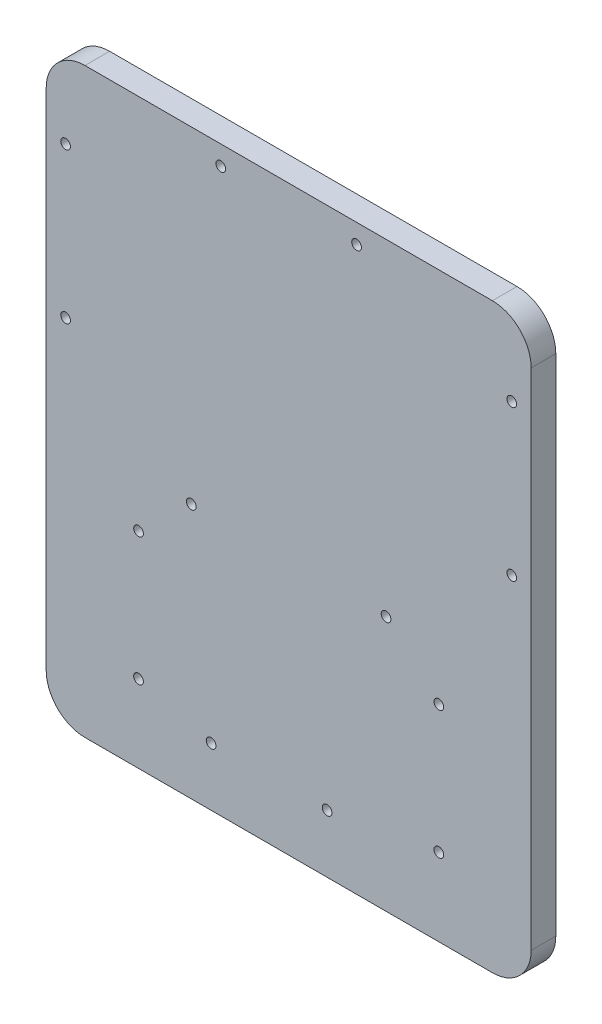
ISO-10303-21;
HEADER;
FILE_DESCRIPTION(('STEP AP214'),'2;1');
FILE_NAME('part.step','',(''),(''),'','','');
FILE_SCHEMA(('AUTOMOTIVE_DESIGN { 1 0 10303 214 1 1 1 1 }'));
ENDSEC;
DATA;
#1=APPLICATION_CONTEXT('core data for automotive mechanical design processes');
#2=APPLICATION_PROTOCOL_DEFINITION('international standard','automotive_design',2000,#1);
#3=PRODUCT_CONTEXT('',#1,'mechanical');
#4=PRODUCT('Part','Part','',(#3));
#5=PRODUCT_RELATED_PRODUCT_CATEGORY('part','',(#4));
#6=PRODUCT_DEFINITION_FORMATION('','',#4);
#7=PRODUCT_DEFINITION_CONTEXT('part definition',#1,'design');
#8=PRODUCT_DEFINITION('design','',#6,#7);
#9=PRODUCT_DEFINITION_SHAPE('','',#8);
#10=(LENGTH_UNIT() NAMED_UNIT(*) SI_UNIT(.MILLI.,.METRE.));
#11=(NAMED_UNIT(*) PLANE_ANGLE_UNIT() SI_UNIT($,.RADIAN.));
#12=(NAMED_UNIT(*) SI_UNIT($,.STERADIAN.) SOLID_ANGLE_UNIT());
#13=UNCERTAINTY_MEASURE_WITH_UNIT(LENGTH_MEASURE(1.E-05),#10,'distance_accuracy_value','');
#14=(GEOMETRIC_REPRESENTATION_CONTEXT(3) GLOBAL_UNCERTAINTY_ASSIGNED_CONTEXT((#13)) GLOBAL_UNIT_ASSIGNED_CONTEXT((#10,
#11,#12)) REPRESENTATION_CONTEXT('',''));
#15=CARTESIAN_POINT('',(0.,0.,0.));
#16=DIRECTION('',(0.,0.,1.));
#17=DIRECTION('',(1.,0.,0.));
#18=AXIS2_PLACEMENT_3D('',#15,#16,#17);
#19=CARTESIAN_POINT('',(0.,0.,6.35));
#20=DIRECTION('',(0.,0.,1.));
#21=DIRECTION('',(1.,0.,0.));
#22=AXIS2_PLACEMENT_3D('',#19,#20,#21);
#23=PLANE('',#22);
#24=CARTESIAN_POINT('',(-57.5,55.,6.35));
#25=DIRECTION('',(0.,0.,1.));
#26=DIRECTION('',(-1.,0.,0.));
#27=AXIS2_PLACEMENT_3D('',#24,#25,#26);
#28=CIRCLE('',#27,1.25);
#29=CARTESIAN_POINT('',(-58.75,55.,6.35));
#30=VERTEX_POINT('',#29);
#31=EDGE_CURVE('E252',#30,#30,#28,.T.);
#32=ORIENTED_EDGE('',*,*,#31,.F.);
#33=EDGE_LOOP('',(#32));
#34=FACE_BOUND('',#33,.T.);
#35=CARTESIAN_POINT('',(-57.5,16.2,6.35));
#36=DIRECTION('',(0.,0.,1.));
#37=DIRECTION('',(-1.,0.,0.));
#38=AXIS2_PLACEMENT_3D('',#35,#36,#37);
#39=CIRCLE('',#38,1.25);
#40=CARTESIAN_POINT('',(-58.75,16.2,6.35));
#41=VERTEX_POINT('',#40);
#42=EDGE_CURVE('E246',#41,#41,#39,.T.);
#43=ORIENTED_EDGE('',*,*,#42,.F.);
#44=EDGE_LOOP('',(#43));
#45=FACE_BOUND('',#44,.T.);
#46=CARTESIAN_POINT('',(57.5,16.2,6.35));
#47=DIRECTION('',(0.,0.,1.));
#48=DIRECTION('',(1.,0.,0.));
#49=AXIS2_PLACEMENT_3D('',#46,#47,#48);
#50=CIRCLE('',#49,1.25);
#51=CARTESIAN_POINT('',(58.75,16.2,6.35));
#52=VERTEX_POINT('',#51);
#53=EDGE_CURVE('E240',#52,#52,#50,.T.);
#54=ORIENTED_EDGE('',*,*,#53,.F.);
#55=EDGE_LOOP('',(#54));
#56=FACE_BOUND('',#55,.T.);
#57=CARTESIAN_POINT('',(57.5,55.,6.35));
#58=DIRECTION('',(0.,0.,1.));
#59=DIRECTION('',(1.,0.,0.));
#60=AXIS2_PLACEMENT_3D('',#57,#58,#59);
#61=CIRCLE('',#60,1.25);
#62=CARTESIAN_POINT('',(58.75,55.,6.35));
#63=VERTEX_POINT('',#62);
#64=EDGE_CURVE('E234',#63,#63,#61,.T.);
#65=ORIENTED_EDGE('',*,*,#64,.F.);
#66=EDGE_LOOP('',(#65));
#67=FACE_BOUND('',#66,.T.);
#68=CARTESIAN_POINT('',(-38.7000000000001,-22.,6.35));
#69=DIRECTION('',(0.,0.,1.));
#70=DIRECTION('',(-1.,0.,0.));
#71=AXIS2_PLACEMENT_3D('',#68,#69,#70);
#72=CIRCLE('',#71,1.25);
#73=CARTESIAN_POINT('',(-39.9500000000001,-22.,6.35));
#74=VERTEX_POINT('',#73);
#75=EDGE_CURVE('E217',#74,#74,#72,.T.);
#76=ORIENTED_EDGE('',*,*,#75,.F.);
#77=EDGE_LOOP('',(#76));
#78=FACE_BOUND('',#77,.T.);
#79=CARTESIAN_POINT('',(38.7,-55.,6.35));
#80=DIRECTION('',(0.,0.,1.));
#81=DIRECTION('',(1.,0.,0.));
#82=AXIS2_PLACEMENT_3D('',#79,#80,#81);
#83=CIRCLE('',#82,1.25);
#84=CARTESIAN_POINT('',(39.95,-55.,6.35));
#85=VERTEX_POINT('',#84);
#86=EDGE_CURVE('E205',#85,#85,#83,.T.);
#87=ORIENTED_EDGE('',*,*,#86,.F.);
#88=EDGE_LOOP('',(#87));
#89=FACE_BOUND('',#88,.T.);
#90=CARTESIAN_POINT('',(-17.5,70.,6.35));
#91=DIRECTION('',(0.,0.,1.));
#92=DIRECTION('',(1.,0.,0.));
#93=AXIS2_PLACEMENT_3D('',#90,#91,#92);
#94=CIRCLE('',#93,1.25);
#95=CARTESIAN_POINT('',(-16.25,70.,6.35));
#96=VERTEX_POINT('',#95);
#97=EDGE_CURVE('E193',#96,#96,#94,.T.);
#98=ORIENTED_EDGE('',*,*,#97,.F.);
#99=EDGE_LOOP('',(#98));
#100=FACE_BOUND('',#99,.T.);
#101=CARTESIAN_POINT('',(-20.,-60.,6.35));
#102=DIRECTION('',(0.,0.,1.));
#103=DIRECTION('',(1.,0.,0.));
#104=AXIS2_PLACEMENT_3D('',#101,#102,#103);
#105=CIRCLE('',#104,1.25);
#106=CARTESIAN_POINT('',(-18.75,-60.,6.35));
#107=VERTEX_POINT('',#106);
#108=EDGE_CURVE('E181',#107,#107,#105,.T.);
#109=ORIENTED_EDGE('',*,*,#108,.F.);
#110=EDGE_LOOP('',(#109));
#111=FACE_BOUND('',#110,.T.);
#112=CARTESIAN_POINT('',(-25.1,-9.19999999999999,6.35));
#113=DIRECTION('',(0.,0.,1.));
#114=DIRECTION('',(1.,0.,0.));
#115=AXIS2_PLACEMENT_3D('',#112,#113,#114);
#116=CIRCLE('',#115,1.25);
#117=CARTESIAN_POINT('',(-23.85,-9.19999999999999,6.35));
#118=VERTEX_POINT('',#117);
#119=EDGE_CURVE('E164',#118,#118,#116,.T.);
#120=ORIENTED_EDGE('',*,*,#119,.F.);
#121=EDGE_LOOP('',(#120));
#122=FACE_BOUND('',#121,.T.);
#123=DIRECTION('',(0.,-1.,0.));
#124=VECTOR('',#123,1.);
#125=CARTESIAN_POINT('',(-62.5,75.,6.35));
#126=LINE('',#125,#124);
#127=CARTESIAN_POINT('',(-62.5,65.,6.35));
#128=VERTEX_POINT('',#127);
#129=CARTESIAN_POINT('',(-62.5,-65.,6.35));
#130=VERTEX_POINT('',#129);
#131=EDGE_CURVE('E171',#128,#130,#126,.T.);
#132=ORIENTED_EDGE('',*,*,#131,.T.);
#133=CARTESIAN_POINT('',(-52.5,-65.,6.35));
#134=DIRECTION('',(0.,0.,1.));
#135=DIRECTION('',(1.,0.,0.));
#136=AXIS2_PLACEMENT_3D('',#133,#134,#135);
#137=CIRCLE('',#136,10.);
#138=CARTESIAN_POINT('',(-52.5,-75.,6.35));
#139=VERTEX_POINT('',#138);
#140=EDGE_CURVE('E148',#130,#139,#137,.T.);
#141=ORIENTED_EDGE('',*,*,#140,.T.);
#142=DIRECTION('',(1.,0.,0.));
#143=VECTOR('',#142,1.);
#144=CARTESIAN_POINT('',(-62.5,-75.,6.35));
#145=LINE('',#144,#143);
#146=CARTESIAN_POINT('',(52.5,-75.,6.35));
#147=VERTEX_POINT('',#146);
#148=EDGE_CURVE('E119',#139,#147,#145,.T.);
#149=ORIENTED_EDGE('',*,*,#148,.T.);
#150=CARTESIAN_POINT('',(52.5,-65.,6.35));
#151=DIRECTION('',(0.,0.,1.));
#152=DIRECTION('',(1.,0.,0.));
#153=AXIS2_PLACEMENT_3D('',#150,#151,#152);
#154=CIRCLE('',#153,10.);
#155=CARTESIAN_POINT('',(62.5,-65.,6.35));
#156=VERTEX_POINT('',#155);
#157=EDGE_CURVE('E146',#147,#156,#154,.T.);
#158=ORIENTED_EDGE('',*,*,#157,.T.);
#159=DIRECTION('',(0.,1.,0.));
#160=VECTOR('',#159,1.);
#161=CARTESIAN_POINT('',(62.5,75.,6.35));
#162=LINE('',#161,#160);
#163=CARTESIAN_POINT('',(62.5,65.,6.35));
#164=VERTEX_POINT('',#163);
#165=EDGE_CURVE('E126',#156,#164,#162,.T.);
#166=ORIENTED_EDGE('',*,*,#165,.T.);
#167=CARTESIAN_POINT('',(52.5,65.,6.35));
#168=DIRECTION('',(0.,0.,1.));
#169=DIRECTION('',(1.,0.,0.));
#170=AXIS2_PLACEMENT_3D('',#167,#168,#169);
#171=CIRCLE('',#170,10.);
#172=CARTESIAN_POINT('',(52.5,75.,6.35));
#173=VERTEX_POINT('',#172);
#174=EDGE_CURVE('E54',#164,#173,#171,.T.);
#175=ORIENTED_EDGE('',*,*,#174,.T.);
#176=DIRECTION('',(-1.,0.,0.));
#177=VECTOR('',#176,1.);
#178=CARTESIAN_POINT('',(-62.5,75.,6.35));
#179=LINE('',#178,#177);
#180=CARTESIAN_POINT('',(-52.5,75.,6.35));
#181=VERTEX_POINT('',#180);
#182=EDGE_CURVE('E129',#173,#181,#179,.T.);
#183=ORIENTED_EDGE('',*,*,#182,.T.);
#184=CARTESIAN_POINT('',(-52.5,65.,6.35));
#185=DIRECTION('',(0.,0.,1.));
#186=DIRECTION('',(1.,0.,0.));
#187=AXIS2_PLACEMENT_3D('',#184,#185,#186);
#188=CIRCLE('',#187,10.);
#189=EDGE_CURVE('E143',#181,#128,#188,.T.);
#190=ORIENTED_EDGE('',*,*,#189,.T.);
#191=EDGE_LOOP('',(#132,#141,#149,#158,#166,#175,#183,#190));
#192=FACE_BOUND('',#191,.T.);
#193=CARTESIAN_POINT('',(25.1,-9.19999999999999,6.35));
#194=DIRECTION('',(0.,0.,1.));
#195=DIRECTION('',(1.,0.,0.));
#196=AXIS2_PLACEMENT_3D('',#193,#194,#195);
#197=CIRCLE('',#196,1.25);
#198=CARTESIAN_POINT('',(26.35,-9.19999999999999,6.35));
#199=VERTEX_POINT('',#198);
#200=EDGE_CURVE('E176',#199,#199,#197,.T.);
#201=ORIENTED_EDGE('',*,*,#200,.F.);
#202=EDGE_LOOP('',(#201));
#203=FACE_BOUND('',#202,.T.);
#204=CARTESIAN_POINT('',(9.9,-60.,6.35));
#205=DIRECTION('',(0.,0.,1.));
#206=DIRECTION('',(1.,0.,0.));
#207=AXIS2_PLACEMENT_3D('',#204,#205,#206);
#208=CIRCLE('',#207,1.25);
#209=CARTESIAN_POINT('',(11.15,-60.,6.35));
#210=VERTEX_POINT('',#209);
#211=EDGE_CURVE('E187',#210,#210,#208,.T.);
#212=ORIENTED_EDGE('',*,*,#211,.F.);
#213=EDGE_LOOP('',(#212));
#214=FACE_BOUND('',#213,.T.);
#215=CARTESIAN_POINT('',(17.5,70.,6.35));
#216=DIRECTION('',(0.,0.,1.));
#217=DIRECTION('',(1.,0.,0.));
#218=AXIS2_PLACEMENT_3D('',#215,#216,#217);
#219=CIRCLE('',#218,1.25);
#220=CARTESIAN_POINT('',(18.75,70.,6.35));
#221=VERTEX_POINT('',#220);
#222=EDGE_CURVE('E199',#221,#221,#219,.T.);
#223=ORIENTED_EDGE('',*,*,#222,.F.);
#224=EDGE_LOOP('',(#223));
#225=FACE_BOUND('',#224,.T.);
#226=CARTESIAN_POINT('',(38.7000000000001,-22.,6.35));
#227=DIRECTION('',(0.,0.,1.));
#228=DIRECTION('',(1.,0.,0.));
#229=AXIS2_PLACEMENT_3D('',#226,#227,#228);
#230=CIRCLE('',#229,1.25);
#231=CARTESIAN_POINT('',(39.9500000000001,-22.,6.35));
#232=VERTEX_POINT('',#231);
#233=EDGE_CURVE('E211',#232,#232,#230,.T.);
#234=ORIENTED_EDGE('',*,*,#233,.F.);
#235=EDGE_LOOP('',(#234));
#236=FACE_BOUND('',#235,.T.);
#237=CARTESIAN_POINT('',(-38.7,-55.,6.35));
#238=DIRECTION('',(0.,0.,1.));
#239=DIRECTION('',(-1.,0.,0.));
#240=AXIS2_PLACEMENT_3D('',#237,#238,#239);
#241=CIRCLE('',#240,1.25);
#242=CARTESIAN_POINT('',(-39.95,-55.,6.35));
#243=VERTEX_POINT('',#242);
#244=EDGE_CURVE('E223',#243,#243,#241,.T.);
#245=ORIENTED_EDGE('',*,*,#244,.F.);
#246=EDGE_LOOP('',(#245));
#247=FACE_BOUND('',#246,.T.);
#248=ADVANCED_FACE('F33',(#34,#45,#56,#67,#78,#89,#100,#111,#122,#192,#203,#214,#225,#236,#247),
#23,.T.);
#249=CARTESIAN_POINT('',(0.,0.,0.));
#250=DIRECTION('',(0.,0.,1.));
#251=DIRECTION('',(1.,0.,0.));
#252=AXIS2_PLACEMENT_3D('',#249,#250,#251);
#253=PLANE('',#252);
#254=CARTESIAN_POINT('',(-57.5,55.,0.));
#255=DIRECTION('',(0.,0.,1.));
#256=DIRECTION('',(1.,0.,0.));
#257=AXIS2_PLACEMENT_3D('',#254,#255,#256);
#258=CIRCLE('',#257,1.25);
#259=CARTESIAN_POINT('',(-56.25,55.,0.));
#260=VERTEX_POINT('',#259);
#261=EDGE_CURVE('E249',#260,#260,#258,.F.);
#262=ORIENTED_EDGE('',*,*,#261,.F.);
#263=EDGE_LOOP('',(#262));
#264=FACE_BOUND('',#263,.T.);
#265=CARTESIAN_POINT('',(-57.5,16.2,0.));
#266=DIRECTION('',(0.,0.,1.));
#267=DIRECTION('',(1.,0.,0.));
#268=AXIS2_PLACEMENT_3D('',#265,#266,#267);
#269=CIRCLE('',#268,1.25);
#270=CARTESIAN_POINT('',(-56.25,16.2,0.));
#271=VERTEX_POINT('',#270);
#272=EDGE_CURVE('E243',#271,#271,#269,.F.);
#273=ORIENTED_EDGE('',*,*,#272,.F.);
#274=EDGE_LOOP('',(#273));
#275=FACE_BOUND('',#274,.T.);
#276=CARTESIAN_POINT('',(57.5,16.2,0.));
#277=DIRECTION('',(0.,0.,1.));
#278=DIRECTION('',(1.,0.,0.));
#279=AXIS2_PLACEMENT_3D('',#276,#277,#278);
#280=CIRCLE('',#279,1.25);
#281=CARTESIAN_POINT('',(58.75,16.2,0.));
#282=VERTEX_POINT('',#281);
#283=EDGE_CURVE('E237',#282,#282,#280,.F.);
#284=ORIENTED_EDGE('',*,*,#283,.F.);
#285=EDGE_LOOP('',(#284));
#286=FACE_BOUND('',#285,.T.);
#287=CARTESIAN_POINT('',(57.5,55.,0.));
#288=DIRECTION('',(0.,0.,1.));
#289=DIRECTION('',(1.,0.,0.));
#290=AXIS2_PLACEMENT_3D('',#287,#288,#289);
#291=CIRCLE('',#290,1.25);
#292=CARTESIAN_POINT('',(58.75,55.,0.));
#293=VERTEX_POINT('',#292);
#294=EDGE_CURVE('E229',#293,#293,#291,.F.);
#295=ORIENTED_EDGE('',*,*,#294,.F.);
#296=EDGE_LOOP('',(#295));
#297=FACE_BOUND('',#296,.T.);
#298=DIRECTION('',(1.,0.,0.));
#299=VECTOR('',#298,1.);
#300=CARTESIAN_POINT('',(-62.5,-75.,0.));
#301=LINE('',#300,#299);
#302=CARTESIAN_POINT('',(-52.5,-75.,0.));
#303=VERTEX_POINT('',#302);
#304=CARTESIAN_POINT('',(52.5,-75.,0.));
#305=VERTEX_POINT('',#304);
#306=EDGE_CURVE('E116',#303,#305,#301,.T.);
#307=ORIENTED_EDGE('',*,*,#306,.F.);
#308=CARTESIAN_POINT('',(-52.5,-65.,0.));
#309=DIRECTION('',(0.,0.,1.));
#310=DIRECTION('',(1.,0.,0.));
#311=AXIS2_PLACEMENT_3D('',#308,#309,#310);
#312=CIRCLE('',#311,10.);
#313=CARTESIAN_POINT('',(-62.5,-65.,0.));
#314=VERTEX_POINT('',#313);
#315=EDGE_CURVE('E99',#303,#314,#312,.F.);
#316=ORIENTED_EDGE('',*,*,#315,.T.);
#317=DIRECTION('',(0.,-1.,0.));
#318=VECTOR('',#317,1.);
#319=CARTESIAN_POINT('',(-62.5,75.,0.));
#320=LINE('',#319,#318);
#321=CARTESIAN_POINT('',(-62.5,65.,0.));
#322=VERTEX_POINT('',#321);
#323=EDGE_CURVE('E127',#322,#314,#320,.T.);
#324=ORIENTED_EDGE('',*,*,#323,.F.);
#325=CARTESIAN_POINT('',(-52.5,65.,0.));
#326=DIRECTION('',(0.,0.,1.));
#327=DIRECTION('',(1.,0.,0.));
#328=AXIS2_PLACEMENT_3D('',#325,#326,#327);
#329=CIRCLE('',#328,10.);
#330=CARTESIAN_POINT('',(-52.5,75.,0.));
#331=VERTEX_POINT('',#330);
#332=EDGE_CURVE('E120',#322,#331,#329,.F.);
#333=ORIENTED_EDGE('',*,*,#332,.T.);
#334=DIRECTION('',(-1.,0.,0.));
#335=VECTOR('',#334,1.);
#336=CARTESIAN_POINT('',(-62.5,75.,0.));
#337=LINE('',#336,#335);
#338=CARTESIAN_POINT('',(52.5,75.,0.));
#339=VERTEX_POINT('',#338);
#340=EDGE_CURVE('E131',#339,#331,#337,.T.);
#341=ORIENTED_EDGE('',*,*,#340,.F.);
#342=CARTESIAN_POINT('',(52.5,65.,0.));
#343=DIRECTION('',(0.,0.,1.));
#344=DIRECTION('',(1.,0.,0.));
#345=AXIS2_PLACEMENT_3D('',#342,#343,#344);
#346=CIRCLE('',#345,10.);
#347=CARTESIAN_POINT('',(62.5,65.,0.));
#348=VERTEX_POINT('',#347);
#349=EDGE_CURVE('E137',#339,#348,#346,.F.);
#350=ORIENTED_EDGE('',*,*,#349,.T.);
#351=DIRECTION('',(0.,1.,0.));
#352=VECTOR('',#351,1.);
#353=CARTESIAN_POINT('',(62.5,75.,0.));
#354=LINE('',#353,#352);
#355=CARTESIAN_POINT('',(62.5,-65.,0.));
#356=VERTEX_POINT('',#355);
#357=EDGE_CURVE('E159',#356,#348,#354,.T.);
#358=ORIENTED_EDGE('',*,*,#357,.F.);
#359=CARTESIAN_POINT('',(52.5,-65.,0.));
#360=DIRECTION('',(0.,0.,1.));
#361=DIRECTION('',(1.,0.,0.));
#362=AXIS2_PLACEMENT_3D('',#359,#360,#361);
#363=CIRCLE('',#362,10.);
#364=EDGE_CURVE('E110',#356,#305,#363,.F.);
#365=ORIENTED_EDGE('',*,*,#364,.T.);
#366=EDGE_LOOP('',(#307,#316,#324,#333,#341,#350,#358,#365));
#367=FACE_BOUND('',#366,.T.);
#368=CARTESIAN_POINT('',(-25.1,-9.19999999999999,0.));
#369=DIRECTION('',(0.,0.,1.));
#370=DIRECTION('',(1.,0.,0.));
#371=AXIS2_PLACEMENT_3D('',#368,#369,#370);
#372=CIRCLE('',#371,1.25);
#373=CARTESIAN_POINT('',(-23.85,-9.19999999999999,0.));
#374=VERTEX_POINT('',#373);
#375=EDGE_CURVE('E167',#374,#374,#372,.T.);
#376=ORIENTED_EDGE('',*,*,#375,.T.);
#377=EDGE_LOOP('',(#376));
#378=FACE_BOUND('',#377,.T.);
#379=CARTESIAN_POINT('',(25.1,-9.19999999999999,0.));
#380=DIRECTION('',(0.,0.,1.));
#381=DIRECTION('',(1.,0.,0.));
#382=AXIS2_PLACEMENT_3D('',#379,#380,#381);
#383=CIRCLE('',#382,1.25);
#384=CARTESIAN_POINT('',(26.35,-9.19999999999999,0.));
#385=VERTEX_POINT('',#384);
#386=EDGE_CURVE('E178',#385,#385,#383,.T.);
#387=ORIENTED_EDGE('',*,*,#386,.T.);
#388=EDGE_LOOP('',(#387));
#389=FACE_BOUND('',#388,.T.);
#390=CARTESIAN_POINT('',(-20.,-60.,0.));
#391=DIRECTION('',(0.,0.,1.));
#392=DIRECTION('',(1.,0.,0.));
#393=AXIS2_PLACEMENT_3D('',#390,#391,#392);
#394=CIRCLE('',#393,1.25);
#395=CARTESIAN_POINT('',(-18.75,-60.,0.));
#396=VERTEX_POINT('',#395);
#397=EDGE_CURVE('E184',#396,#396,#394,.T.);
#398=ORIENTED_EDGE('',*,*,#397,.T.);
#399=EDGE_LOOP('',(#398));
#400=FACE_BOUND('',#399,.T.);
#401=CARTESIAN_POINT('',(9.9,-60.,0.));
#402=DIRECTION('',(0.,0.,1.));
#403=DIRECTION('',(1.,0.,0.));
#404=AXIS2_PLACEMENT_3D('',#401,#402,#403);
#405=CIRCLE('',#404,1.25);
#406=CARTESIAN_POINT('',(11.15,-60.,0.));
#407=VERTEX_POINT('',#406);
#408=EDGE_CURVE('E190',#407,#407,#405,.T.);
#409=ORIENTED_EDGE('',*,*,#408,.T.);
#410=EDGE_LOOP('',(#409));
#411=FACE_BOUND('',#410,.T.);
#412=CARTESIAN_POINT('',(-17.5,70.,0.));
#413=DIRECTION('',(0.,0.,1.));
#414=DIRECTION('',(1.,0.,0.));
#415=AXIS2_PLACEMENT_3D('',#412,#413,#414);
#416=CIRCLE('',#415,1.25);
#417=CARTESIAN_POINT('',(-16.25,70.,0.));
#418=VERTEX_POINT('',#417);
#419=EDGE_CURVE('E196',#418,#418,#416,.T.);
#420=ORIENTED_EDGE('',*,*,#419,.T.);
#421=EDGE_LOOP('',(#420));
#422=FACE_BOUND('',#421,.T.);
#423=CARTESIAN_POINT('',(17.5,70.,0.));
#424=DIRECTION('',(0.,0.,1.));
#425=DIRECTION('',(1.,0.,0.));
#426=AXIS2_PLACEMENT_3D('',#423,#424,#425);
#427=CIRCLE('',#426,1.25);
#428=CARTESIAN_POINT('',(18.75,70.,0.));
#429=VERTEX_POINT('',#428);
#430=EDGE_CURVE('E202',#429,#429,#427,.T.);
#431=ORIENTED_EDGE('',*,*,#430,.T.);
#432=EDGE_LOOP('',(#431));
#433=FACE_BOUND('',#432,.T.);
#434=CARTESIAN_POINT('',(38.7,-55.,0.));
#435=DIRECTION('',(0.,0.,1.));
#436=DIRECTION('',(1.,0.,0.));
#437=AXIS2_PLACEMENT_3D('',#434,#435,#436);
#438=CIRCLE('',#437,1.25);
#439=CARTESIAN_POINT('',(39.95,-55.,0.));
#440=VERTEX_POINT('',#439);
#441=EDGE_CURVE('E208',#440,#440,#438,.T.);
#442=ORIENTED_EDGE('',*,*,#441,.T.);
#443=EDGE_LOOP('',(#442));
#444=FACE_BOUND('',#443,.T.);
#445=CARTESIAN_POINT('',(38.7000000000001,-22.,0.));
#446=DIRECTION('',(0.,0.,1.));
#447=DIRECTION('',(1.,0.,0.));
#448=AXIS2_PLACEMENT_3D('',#445,#446,#447);
#449=CIRCLE('',#448,1.25);
#450=CARTESIAN_POINT('',(39.9500000000001,-22.,0.));
#451=VERTEX_POINT('',#450);
#452=EDGE_CURVE('E214',#451,#451,#449,.T.);
#453=ORIENTED_EDGE('',*,*,#452,.T.);
#454=EDGE_LOOP('',(#453));
#455=FACE_BOUND('',#454,.T.);
#456=CARTESIAN_POINT('',(-38.7000000000001,-22.,0.));
#457=DIRECTION('',(0.,0.,1.));
#458=DIRECTION('',(-1.,0.,0.));
#459=AXIS2_PLACEMENT_3D('',#456,#457,#458);
#460=CIRCLE('',#459,1.25);
#461=CARTESIAN_POINT('',(-39.9500000000001,-22.,0.));
#462=VERTEX_POINT('',#461);
#463=EDGE_CURVE('E220',#462,#462,#460,.T.);
#464=ORIENTED_EDGE('',*,*,#463,.T.);
#465=EDGE_LOOP('',(#464));
#466=FACE_BOUND('',#465,.T.);
#467=CARTESIAN_POINT('',(-38.7,-55.,0.));
#468=DIRECTION('',(0.,0.,1.));
#469=DIRECTION('',(-1.,0.,0.));
#470=AXIS2_PLACEMENT_3D('',#467,#468,#469);
#471=CIRCLE('',#470,1.25);
#472=CARTESIAN_POINT('',(-39.95,-55.,0.));
#473=VERTEX_POINT('',#472);
#474=EDGE_CURVE('E226',#473,#473,#471,.T.);
#475=ORIENTED_EDGE('',*,*,#474,.T.);
#476=EDGE_LOOP('',(#475));
#477=FACE_BOUND('',#476,.T.);
#478=ADVANCED_FACE('F123',(#264,#275,#286,#297,#367,#378,#389,#400,#411,#422,#433,#444,#455,
#466,#477),#253,.F.);
#479=CARTESIAN_POINT('',(62.5,75.,6.35));
#480=DIRECTION('',(-1.,0.,0.));
#481=DIRECTION('',(0.,-1.,0.));
#482=AXIS2_PLACEMENT_3D('',#479,#480,#481);
#483=PLANE('',#482);
#484=ORIENTED_EDGE('',*,*,#165,.F.);
#485=DIRECTION('',(0.,0.,-1.));
#486=VECTOR('',#485,1.);
#487=CARTESIAN_POINT('',(62.5,-65.,6.35));
#488=LINE('',#487,#486);
#489=EDGE_CURVE('E152',#156,#356,#488,.T.);
#490=ORIENTED_EDGE('',*,*,#489,.T.);
#491=ORIENTED_EDGE('',*,*,#357,.T.);
#492=DIRECTION('',(0.,0.,-1.));
#493=VECTOR('',#492,1.);
#494=CARTESIAN_POINT('',(62.5,65.,6.35));
#495=LINE('',#494,#493);
#496=EDGE_CURVE('E150',#348,#164,#495,.F.);
#497=ORIENTED_EDGE('',*,*,#496,.T.);
#498=EDGE_LOOP('',(#484,#490,#491,#497));
#499=FACE_BOUND('',#498,.T.);
#500=ADVANCED_FACE('F158',(#499),#483,.F.);
#501=CARTESIAN_POINT('',(-62.5,75.,6.35));
#502=DIRECTION('',(0.,-1.,0.));
#503=DIRECTION('',(0.,0.,-1.));
#504=AXIS2_PLACEMENT_3D('',#501,#502,#503);
#505=PLANE('',#504);
#506=ORIENTED_EDGE('',*,*,#182,.F.);
#507=DIRECTION('',(0.,0.,-1.));
#508=VECTOR('',#507,1.);
#509=CARTESIAN_POINT('',(52.5,75.,6.35));
#510=LINE('',#509,#508);
#511=EDGE_CURVE('E11',#173,#339,#510,.T.);
#512=ORIENTED_EDGE('',*,*,#511,.T.);
#513=ORIENTED_EDGE('',*,*,#340,.T.);
#514=DIRECTION('',(0.,0.,-1.));
#515=VECTOR('',#514,1.);
#516=CARTESIAN_POINT('',(-52.5,75.,6.35));
#517=LINE('',#516,#515);
#518=EDGE_CURVE('E41',#331,#181,#517,.F.);
#519=ORIENTED_EDGE('',*,*,#518,.T.);
#520=EDGE_LOOP('',(#506,#512,#513,#519));
#521=FACE_BOUND('',#520,.T.);
#522=ADVANCED_FACE('F303',(#521),#505,.F.);
#523=CARTESIAN_POINT('',(-62.5,75.,6.35));
#524=DIRECTION('',(1.,0.,0.));
#525=DIRECTION('',(0.,1.,0.));
#526=AXIS2_PLACEMENT_3D('',#523,#524,#525);
#527=PLANE('',#526);
#528=ORIENTED_EDGE('',*,*,#323,.T.);
#529=DIRECTION('',(0.,0.,-1.));
#530=VECTOR('',#529,1.);
#531=CARTESIAN_POINT('',(-62.5,-65.,6.35));
#532=LINE('',#531,#530);
#533=EDGE_CURVE('E104',#314,#130,#532,.F.);
#534=ORIENTED_EDGE('',*,*,#533,.T.);
#535=ORIENTED_EDGE('',*,*,#131,.F.);
#536=DIRECTION('',(0.,0.,-1.));
#537=VECTOR('',#536,1.);
#538=CARTESIAN_POINT('',(-62.5,65.,6.35));
#539=LINE('',#538,#537);
#540=EDGE_CURVE('E109',#128,#322,#539,.T.);
#541=ORIENTED_EDGE('',*,*,#540,.T.);
#542=EDGE_LOOP('',(#528,#534,#535,#541));
#543=FACE_BOUND('',#542,.T.);
#544=ADVANCED_FACE('F312',(#543),#527,.F.);
#545=CARTESIAN_POINT('',(-62.5,-75.,6.35));
#546=DIRECTION('',(0.,1.,0.));
#547=DIRECTION('',(0.,0.,1.));
#548=AXIS2_PLACEMENT_3D('',#545,#546,#547);
#549=PLANE('',#548);
#550=ORIENTED_EDGE('',*,*,#148,.F.);
#551=DIRECTION('',(0.,0.,-1.));
#552=VECTOR('',#551,1.);
#553=CARTESIAN_POINT('',(-52.5,-75.,6.35));
#554=LINE('',#553,#552);
#555=EDGE_CURVE('E103',#139,#303,#554,.T.);
#556=ORIENTED_EDGE('',*,*,#555,.T.);
#557=ORIENTED_EDGE('',*,*,#306,.T.);
#558=DIRECTION('',(0.,0.,-1.));
#559=VECTOR('',#558,1.);
#560=CARTESIAN_POINT('',(52.5,-75.,6.35));
#561=LINE('',#560,#559);
#562=EDGE_CURVE('E121',#305,#147,#561,.F.);
#563=ORIENTED_EDGE('',*,*,#562,.T.);
#564=EDGE_LOOP('',(#550,#556,#557,#563));
#565=FACE_BOUND('',#564,.T.);
#566=ADVANCED_FACE('F115',(#565),#549,.F.);
#567=CARTESIAN_POINT('',(-25.1,-9.19999999999999,6.35));
#568=DIRECTION('',(0.,0.,-1.));
#569=DIRECTION('',(-1.,0.,0.));
#570=AXIS2_PLACEMENT_3D('',#567,#568,#569);
#571=CYLINDRICAL_SURFACE('',#570,1.25);
#572=ORIENTED_EDGE('',*,*,#119,.T.);
#573=EDGE_LOOP('',(#572));
#574=FACE_BOUND('',#573,.T.);
#575=ORIENTED_EDGE('',*,*,#375,.F.);
#576=EDGE_LOOP('',(#575));
#577=FACE_BOUND('',#576,.T.);
#578=ADVANCED_FACE('F311',(#574,#577),#571,.F.);
#579=CARTESIAN_POINT('',(25.1,-9.19999999999999,6.35));
#580=DIRECTION('',(0.,0.,-1.));
#581=DIRECTION('',(-1.,0.,0.));
#582=AXIS2_PLACEMENT_3D('',#579,#580,#581);
#583=CYLINDRICAL_SURFACE('',#582,1.25);
#584=ORIENTED_EDGE('',*,*,#200,.T.);
#585=EDGE_LOOP('',(#584));
#586=FACE_BOUND('',#585,.T.);
#587=ORIENTED_EDGE('',*,*,#386,.F.);
#588=EDGE_LOOP('',(#587));
#589=FACE_BOUND('',#588,.T.);
#590=ADVANCED_FACE('F373',(#586,#589),#583,.F.);
#591=CARTESIAN_POINT('',(-20.,-60.,6.35));
#592=DIRECTION('',(0.,0.,-1.));
#593=DIRECTION('',(-1.,0.,0.));
#594=AXIS2_PLACEMENT_3D('',#591,#592,#593);
#595=CYLINDRICAL_SURFACE('',#594,1.25);
#596=ORIENTED_EDGE('',*,*,#108,.T.);
#597=EDGE_LOOP('',(#596));
#598=FACE_BOUND('',#597,.T.);
#599=ORIENTED_EDGE('',*,*,#397,.F.);
#600=EDGE_LOOP('',(#599));
#601=FACE_BOUND('',#600,.T.);
#602=ADVANCED_FACE('F369',(#598,#601),#595,.F.);
#603=CARTESIAN_POINT('',(9.9,-60.,6.35));
#604=DIRECTION('',(0.,0.,-1.));
#605=DIRECTION('',(-1.,0.,0.));
#606=AXIS2_PLACEMENT_3D('',#603,#604,#605);
#607=CYLINDRICAL_SURFACE('',#606,1.25);
#608=ORIENTED_EDGE('',*,*,#211,.T.);
#609=EDGE_LOOP('',(#608));
#610=FACE_BOUND('',#609,.T.);
#611=ORIENTED_EDGE('',*,*,#408,.F.);
#612=EDGE_LOOP('',(#611));
#613=FACE_BOUND('',#612,.T.);
#614=ADVANCED_FACE('F365',(#610,#613),#607,.F.);
#615=CARTESIAN_POINT('',(-17.5,70.,6.35));
#616=DIRECTION('',(0.,0.,-1.));
#617=DIRECTION('',(-1.,0.,0.));
#618=AXIS2_PLACEMENT_3D('',#615,#616,#617);
#619=CYLINDRICAL_SURFACE('',#618,1.25);
#620=ORIENTED_EDGE('',*,*,#97,.T.);
#621=EDGE_LOOP('',(#620));
#622=FACE_BOUND('',#621,.T.);
#623=ORIENTED_EDGE('',*,*,#419,.F.);
#624=EDGE_LOOP('',(#623));
#625=FACE_BOUND('',#624,.T.);
#626=ADVANCED_FACE('F361',(#622,#625),#619,.F.);
#627=CARTESIAN_POINT('',(17.5,70.,6.35));
#628=DIRECTION('',(0.,0.,-1.));
#629=DIRECTION('',(-1.,0.,0.));
#630=AXIS2_PLACEMENT_3D('',#627,#628,#629);
#631=CYLINDRICAL_SURFACE('',#630,1.25);
#632=ORIENTED_EDGE('',*,*,#222,.T.);
#633=EDGE_LOOP('',(#632));
#634=FACE_BOUND('',#633,.T.);
#635=ORIENTED_EDGE('',*,*,#430,.F.);
#636=EDGE_LOOP('',(#635));
#637=FACE_BOUND('',#636,.T.);
#638=ADVANCED_FACE('F357',(#634,#637),#631,.F.);
#639=CARTESIAN_POINT('',(38.7,-55.,6.35));
#640=DIRECTION('',(0.,0.,-1.));
#641=DIRECTION('',(-1.,0.,0.));
#642=AXIS2_PLACEMENT_3D('',#639,#640,#641);
#643=CYLINDRICAL_SURFACE('',#642,1.25);
#644=ORIENTED_EDGE('',*,*,#86,.T.);
#645=EDGE_LOOP('',(#644));
#646=FACE_BOUND('',#645,.T.);
#647=ORIENTED_EDGE('',*,*,#441,.F.);
#648=EDGE_LOOP('',(#647));
#649=FACE_BOUND('',#648,.T.);
#650=ADVANCED_FACE('F353',(#646,#649),#643,.F.);
#651=CARTESIAN_POINT('',(38.7000000000001,-22.,6.35));
#652=DIRECTION('',(0.,0.,-1.));
#653=DIRECTION('',(-1.,0.,0.));
#654=AXIS2_PLACEMENT_3D('',#651,#652,#653);
#655=CYLINDRICAL_SURFACE('',#654,1.25);
#656=ORIENTED_EDGE('',*,*,#233,.T.);
#657=EDGE_LOOP('',(#656));
#658=FACE_BOUND('',#657,.T.);
#659=ORIENTED_EDGE('',*,*,#452,.F.);
#660=EDGE_LOOP('',(#659));
#661=FACE_BOUND('',#660,.T.);
#662=ADVANCED_FACE('F349',(#658,#661),#655,.F.);
#663=CARTESIAN_POINT('',(-38.7000000000001,-22.,6.35));
#664=DIRECTION('',(0.,0.,-1.));
#665=DIRECTION('',(-1.,0.,0.));
#666=AXIS2_PLACEMENT_3D('',#663,#664,#665);
#667=CYLINDRICAL_SURFACE('',#666,1.25);
#668=ORIENTED_EDGE('',*,*,#75,.T.);
#669=EDGE_LOOP('',(#668));
#670=FACE_BOUND('',#669,.T.);
#671=ORIENTED_EDGE('',*,*,#463,.F.);
#672=EDGE_LOOP('',(#671));
#673=FACE_BOUND('',#672,.T.);
#674=ADVANCED_FACE('F292',(#670,#673),#667,.F.);
#675=CARTESIAN_POINT('',(-38.7,-55.,6.35));
#676=DIRECTION('',(0.,0.,-1.));
#677=DIRECTION('',(-1.,0.,0.));
#678=AXIS2_PLACEMENT_3D('',#675,#676,#677);
#679=CYLINDRICAL_SURFACE('',#678,1.25);
#680=ORIENTED_EDGE('',*,*,#244,.T.);
#681=EDGE_LOOP('',(#680));
#682=FACE_BOUND('',#681,.T.);
#683=ORIENTED_EDGE('',*,*,#474,.F.);
#684=EDGE_LOOP('',(#683));
#685=FACE_BOUND('',#684,.T.);
#686=ADVANCED_FACE('F289',(#682,#685),#679,.F.);
#687=CARTESIAN_POINT('',(-52.5,-65.,6.35));
#688=DIRECTION('',(0.,0.,-1.));
#689=DIRECTION('',(-1.,0.,0.));
#690=AXIS2_PLACEMENT_3D('',#687,#688,#689);
#691=CYLINDRICAL_SURFACE('',#690,10.);
#692=ORIENTED_EDGE('',*,*,#140,.F.);
#693=ORIENTED_EDGE('',*,*,#533,.F.);
#694=ORIENTED_EDGE('',*,*,#315,.F.);
#695=ORIENTED_EDGE('',*,*,#555,.F.);
#696=EDGE_LOOP('',(#692,#693,#694,#695));
#697=FACE_BOUND('',#696,.T.);
#698=ADVANCED_FACE('F102',(#697),#691,.T.);
#699=CARTESIAN_POINT('',(52.5,-65.,6.35));
#700=DIRECTION('',(0.,0.,-1.));
#701=DIRECTION('',(-1.,0.,0.));
#702=AXIS2_PLACEMENT_3D('',#699,#700,#701);
#703=CYLINDRICAL_SURFACE('',#702,10.);
#704=ORIENTED_EDGE('',*,*,#157,.F.);
#705=ORIENTED_EDGE('',*,*,#562,.F.);
#706=ORIENTED_EDGE('',*,*,#364,.F.);
#707=ORIENTED_EDGE('',*,*,#489,.F.);
#708=EDGE_LOOP('',(#704,#705,#706,#707));
#709=FACE_BOUND('',#708,.T.);
#710=ADVANCED_FACE('F320',(#709),#703,.T.);
#711=CARTESIAN_POINT('',(52.5,65.,6.35));
#712=DIRECTION('',(0.,0.,-1.));
#713=DIRECTION('',(-1.,0.,0.));
#714=AXIS2_PLACEMENT_3D('',#711,#712,#713);
#715=CYLINDRICAL_SURFACE('',#714,10.);
#716=ORIENTED_EDGE('',*,*,#174,.F.);
#717=ORIENTED_EDGE('',*,*,#496,.F.);
#718=ORIENTED_EDGE('',*,*,#349,.F.);
#719=ORIENTED_EDGE('',*,*,#511,.F.);
#720=EDGE_LOOP('',(#716,#717,#718,#719));
#721=FACE_BOUND('',#720,.T.);
#722=ADVANCED_FACE('F322',(#721),#715,.T.);
#723=CARTESIAN_POINT('',(-52.5,65.,6.35));
#724=DIRECTION('',(0.,0.,-1.));
#725=DIRECTION('',(-1.,0.,0.));
#726=AXIS2_PLACEMENT_3D('',#723,#724,#725);
#727=CYLINDRICAL_SURFACE('',#726,10.);
#728=ORIENTED_EDGE('',*,*,#189,.F.);
#729=ORIENTED_EDGE('',*,*,#518,.F.);
#730=ORIENTED_EDGE('',*,*,#332,.F.);
#731=ORIENTED_EDGE('',*,*,#540,.F.);
#732=EDGE_LOOP('',(#728,#729,#730,#731));
#733=FACE_BOUND('',#732,.T.);
#734=ADVANCED_FACE('F35',(#733),#727,.T.);
#735=CARTESIAN_POINT('',(57.5,55.,-0.00100000000000013));
#736=DIRECTION('',(0.,0.,1.));
#737=DIRECTION('',(1.,0.,0.));
#738=AXIS2_PLACEMENT_3D('',#735,#736,#737);
#739=CYLINDRICAL_SURFACE('',#738,1.25);
#740=ORIENTED_EDGE('',*,*,#64,.T.);
#741=EDGE_LOOP('',(#740));
#742=FACE_BOUND('',#741,.T.);
#743=ORIENTED_EDGE('',*,*,#294,.T.);
#744=EDGE_LOOP('',(#743));
#745=FACE_BOUND('',#744,.T.);
#746=ADVANCED_FACE('F328',(#742,#745),#739,.F.);
#747=CARTESIAN_POINT('',(57.5,16.2,-0.00100000000000013));
#748=DIRECTION('',(0.,0.,1.));
#749=DIRECTION('',(1.,0.,0.));
#750=AXIS2_PLACEMENT_3D('',#747,#748,#749);
#751=CYLINDRICAL_SURFACE('',#750,1.25);
#752=ORIENTED_EDGE('',*,*,#53,.T.);
#753=EDGE_LOOP('',(#752));
#754=FACE_BOUND('',#753,.T.);
#755=ORIENTED_EDGE('',*,*,#283,.T.);
#756=EDGE_LOOP('',(#755));
#757=FACE_BOUND('',#756,.T.);
#758=ADVANCED_FACE('F336',(#754,#757),#751,.F.);
#759=CARTESIAN_POINT('',(-57.5,16.2,-0.00100000000000013));
#760=DIRECTION('',(0.,0.,1.));
#761=DIRECTION('',(1.,0.,0.));
#762=AXIS2_PLACEMENT_3D('',#759,#760,#761);
#763=CYLINDRICAL_SURFACE('',#762,1.25);
#764=ORIENTED_EDGE('',*,*,#42,.T.);
#765=EDGE_LOOP('',(#764));
#766=FACE_BOUND('',#765,.T.);
#767=ORIENTED_EDGE('',*,*,#272,.T.);
#768=EDGE_LOOP('',(#767));
#769=FACE_BOUND('',#768,.T.);
#770=ADVANCED_FACE('F341',(#766,#769),#763,.F.);
#771=CARTESIAN_POINT('',(-57.5,55.,-0.00100000000000013));
#772=DIRECTION('',(0.,0.,1.));
#773=DIRECTION('',(1.,0.,0.));
#774=AXIS2_PLACEMENT_3D('',#771,#772,#773);
#775=CYLINDRICAL_SURFACE('',#774,1.25);
#776=ORIENTED_EDGE('',*,*,#31,.T.);
#777=EDGE_LOOP('',(#776));
#778=FACE_BOUND('',#777,.T.);
#779=ORIENTED_EDGE('',*,*,#261,.T.);
#780=EDGE_LOOP('',(#779));
#781=FACE_BOUND('',#780,.T.);
#782=ADVANCED_FACE('F256',(#778,#781),#775,.F.);
#783=CLOSED_SHELL('',(#248,#478,#500,#522,#544,#566,#578,#590,#602,#614,#626,#638,#650,#662,
#674,#686,#698,#710,#722,#734,#746,#758,#770,#782));
#784=MANIFOLD_SOLID_BREP('B2',#783);
#785=ADVANCED_BREP_SHAPE_REPRESENTATION('',(#18,#784),#14);
#786=SHAPE_DEFINITION_REPRESENTATION(#9,#785);
ENDSEC;
END-ISO-10303-21;
